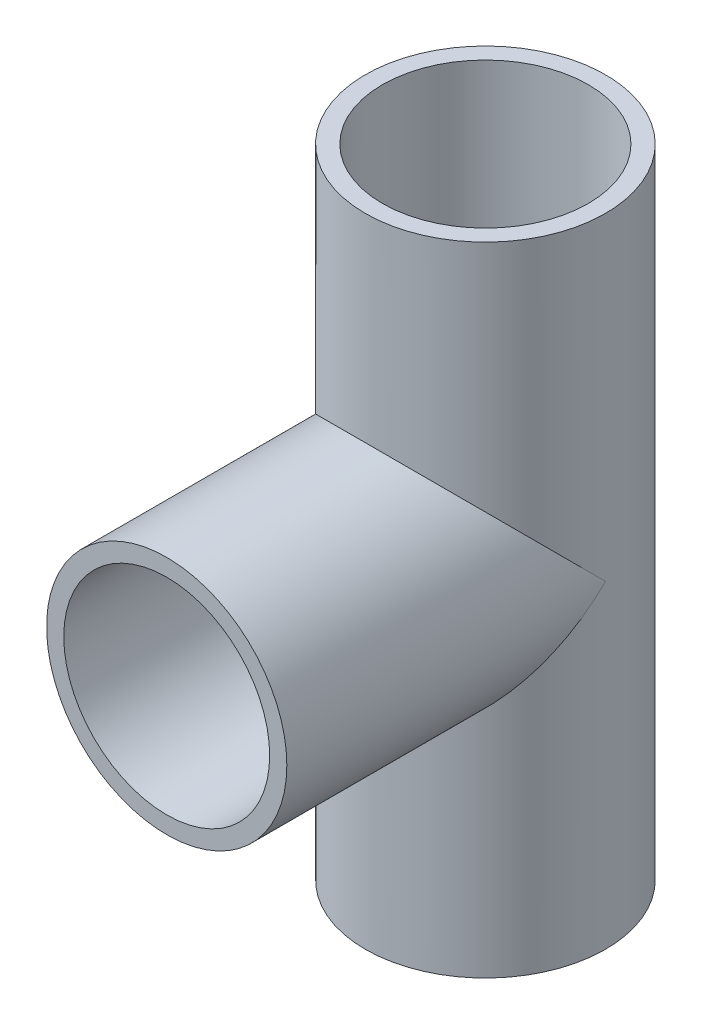
ISO-10303-21;
HEADER;
FILE_DESCRIPTION(('STEP AP214'),'2;1');
FILE_NAME('part.step','',(''),(''),'','','');
FILE_SCHEMA(('AUTOMOTIVE_DESIGN { 1 0 10303 214 1 1 1 1 }'));
ENDSEC;
DATA;
#1=APPLICATION_CONTEXT('core data for automotive mechanical design processes');
#2=APPLICATION_PROTOCOL_DEFINITION('international standard','automotive_design',2000,#1);
#3=PRODUCT_CONTEXT('',#1,'mechanical');
#4=PRODUCT('Part','Part','',(#3));
#5=PRODUCT_RELATED_PRODUCT_CATEGORY('part','',(#4));
#6=PRODUCT_DEFINITION_FORMATION('','',#4);
#7=PRODUCT_DEFINITION_CONTEXT('part definition',#1,'design');
#8=PRODUCT_DEFINITION('design','',#6,#7);
#9=PRODUCT_DEFINITION_SHAPE('','',#8);
#10=(LENGTH_UNIT() NAMED_UNIT(*) SI_UNIT(.MILLI.,.METRE.));
#11=(NAMED_UNIT(*) PLANE_ANGLE_UNIT() SI_UNIT($,.RADIAN.));
#12=(NAMED_UNIT(*) SI_UNIT($,.STERADIAN.) SOLID_ANGLE_UNIT());
#13=UNCERTAINTY_MEASURE_WITH_UNIT(LENGTH_MEASURE(1.E-05),#10,'distance_accuracy_value','');
#14=(GEOMETRIC_REPRESENTATION_CONTEXT(3) GLOBAL_UNCERTAINTY_ASSIGNED_CONTEXT((#13)) GLOBAL_UNIT_ASSIGNED_CONTEXT((#10,
#11,#12)) REPRESENTATION_CONTEXT('',''));
#15=CARTESIAN_POINT('',(0.,0.,0.));
#16=DIRECTION('',(0.,0.,1.));
#17=DIRECTION('',(1.,0.,0.));
#18=AXIS2_PLACEMENT_3D('',#15,#16,#17);
#19=CARTESIAN_POINT('',(0.,130.,0.));
#20=DIRECTION('',(0.,-1.,0.));
#21=DIRECTION('',(0.,0.,-1.));
#22=AXIS2_PLACEMENT_3D('',#19,#20,#21);
#23=CYLINDRICAL_SURFACE('',#22,24.5);
#24=CARTESIAN_POINT('',(0.,0.,0.));
#25=DIRECTION('',(0.,1.,0.));
#26=DIRECTION('',(0.,0.,1.));
#27=AXIS2_PLACEMENT_3D('',#24,#25,#26);
#28=CIRCLE('',#27,24.5);
#29=CARTESIAN_POINT('',(0.,0.,24.5));
#30=VERTEX_POINT('',#29);
#31=EDGE_CURVE('E114',#30,#30,#28,.T.);
#32=ORIENTED_EDGE('',*,*,#31,.T.);
#33=EDGE_LOOP('',(#32));
#34=FACE_BOUND('',#33,.T.);
#35=CARTESIAN_POINT('',(0.,130.,0.));
#36=DIRECTION('',(0.,1.,0.));
#37=DIRECTION('',(0.,0.,1.));
#38=AXIS2_PLACEMENT_3D('',#35,#36,#37);
#39=CIRCLE('',#38,24.5);
#40=CARTESIAN_POINT('',(0.,130.,24.5));
#41=VERTEX_POINT('',#40);
#42=EDGE_CURVE('E118',#41,#41,#39,.T.);
#43=ORIENTED_EDGE('',*,*,#42,.F.);
#44=EDGE_LOOP('',(#43));
#45=FACE_BOUND('',#44,.T.);
#46=CARTESIAN_POINT('',(0.,65.,0.));
#47=DIRECTION('',(0.,-0.707106781186547,-0.707106781186547));
#48=DIRECTION('',(0.,-0.707106781186547,0.707106781186547));
#49=AXIS2_PLACEMENT_3D('',#46,#47,#48);
#50=ELLIPSE('',#49,34.6482322781408,24.5);
#51=CARTESIAN_POINT('',(-24.5,65.,0.));
#52=VERTEX_POINT('',#51);
#53=CARTESIAN_POINT('',(24.5,65.,0.));
#54=VERTEX_POINT('',#53);
#55=EDGE_CURVE('E89',#52,#54,#50,.F.);
#56=ORIENTED_EDGE('',*,*,#55,.F.);
#57=CARTESIAN_POINT('',(0.,65.,0.));
#58=DIRECTION('',(0.,-0.707106781186547,0.707106781186547));
#59=DIRECTION('',(0.,-0.707106781186547,-0.707106781186547));
#60=AXIS2_PLACEMENT_3D('',#57,#58,#59);
#61=ELLIPSE('',#60,34.6482322781408,24.5);
#62=EDGE_CURVE('E91',#54,#52,#61,.T.);
#63=ORIENTED_EDGE('',*,*,#62,.F.);
#64=EDGE_LOOP('',(#56,#63));
#65=FACE_BOUND('',#64,.T.);
#66=ADVANCED_FACE('F39',(#34,#45,#65),#23,.T.);
#67=CARTESIAN_POINT('',(0.,130.,0.));
#68=DIRECTION('',(0.,-1.,0.));
#69=DIRECTION('',(0.,0.,-1.));
#70=AXIS2_PLACEMENT_3D('',#67,#68,#69);
#71=CYLINDRICAL_SURFACE('',#70,21.);
#72=CARTESIAN_POINT('',(0.,130.,0.));
#73=DIRECTION('',(0.,1.,0.));
#74=DIRECTION('',(0.,0.,1.));
#75=AXIS2_PLACEMENT_3D('',#72,#73,#74);
#76=CIRCLE('',#75,21.);
#77=CARTESIAN_POINT('',(0.,130.,21.));
#78=VERTEX_POINT('',#77);
#79=EDGE_CURVE('E110',#78,#78,#76,.T.);
#80=ORIENTED_EDGE('',*,*,#79,.T.);
#81=EDGE_LOOP('',(#80));
#82=FACE_BOUND('',#81,.T.);
#83=CARTESIAN_POINT('',(0.,0.,0.));
#84=DIRECTION('',(0.,1.,0.));
#85=DIRECTION('',(0.,0.,1.));
#86=AXIS2_PLACEMENT_3D('',#83,#84,#85);
#87=CIRCLE('',#86,21.);
#88=CARTESIAN_POINT('',(0.,0.,21.));
#89=VERTEX_POINT('',#88);
#90=EDGE_CURVE('E94',#89,#89,#87,.T.);
#91=ORIENTED_EDGE('',*,*,#90,.F.);
#92=EDGE_LOOP('',(#91));
#93=FACE_BOUND('',#92,.T.);
#94=CARTESIAN_POINT('',(21.,77.619429464124,0.));
#95=CARTESIAN_POINT('',(21.0000033866168,77.6194162914974,0.178405705513538));
#96=CARTESIAN_POINT('',(20.9977258013646,77.623214750097,0.356781199646762));
#97=CARTESIAN_POINT('',(20.9886459828666,77.6383090448937,0.713071315321174));
#98=CARTESIAN_POINT('',(20.9818444796533,77.6496036714207,0.890986006573329));
#99=CARTESIAN_POINT('',(20.9547515279878,77.6944743180999,1.42268837650123));
#100=CARTESIAN_POINT('',(20.9277712557827,77.739038305195,1.77527834255355));
#101=CARTESIAN_POINT('',(20.8572674545965,77.8541354649111,2.46860742822363));
#102=CARTESIAN_POINT('',(20.8140112940652,77.9242483803568,2.80944573941519));
#103=CARTESIAN_POINT('',(20.7118890969017,78.0872797697454,3.48337531312922));
#104=CARTESIAN_POINT('',(20.6530135926556,78.1802120730337,3.81646174322786));
#105=CARTESIAN_POINT('',(20.4923590612934,78.4292031966646,4.6143694401832));
#106=CARTESIAN_POINT('',(20.3830029708772,78.5952551534269,5.07454495747525));
#107=CARTESIAN_POINT('',(20.1372669534914,78.9566544941007,5.97569148692239));
#108=CARTESIAN_POINT('',(20.0008749979289,79.1520149082681,6.41665384399687));
#109=CARTESIAN_POINT('',(19.7018188557052,79.5655077195985,7.28356937274775));
#110=CARTESIAN_POINT('',(19.5389364065977,79.783823460404,7.70935857142068));
#111=CARTESIAN_POINT('',(19.1891710418478,80.2350654843079,8.54283184905344));
#112=CARTESIAN_POINT('',(19.0022890926396,80.4679911788858,8.95051665616872));
#113=CARTESIAN_POINT('',(18.6531918795388,80.8859602121294,9.65260972052875));
#114=CARTESIAN_POINT('',(18.4958739262279,81.0690267558893,9.95065454051124));
#115=CARTESIAN_POINT('',(18.1681132471236,81.4386960890834,10.5371966047626));
#116=CARTESIAN_POINT('',(17.9976693252157,81.6252991996192,10.8256929754884));
#117=CARTESIAN_POINT('',(17.4667252279838,82.1880546919175,11.6773962961455));
#118=CARTESIAN_POINT('',(17.0866738562334,82.5670787979452,12.2266949422212));
#119=CARTESIAN_POINT('',(16.2759104482845,83.3207738589369,13.2867911339944));
#120=CARTESIAN_POINT('',(15.8453242060187,83.6954531751804,13.7976792969827));
#121=CARTESIAN_POINT('',(14.932523326238,84.4322808440698,14.7807059182648));
#122=CARTESIAN_POINT('',(14.4503302845369,84.7944343550707,15.2528604403756));
#123=CARTESIAN_POINT('',(13.5470371420192,85.4195707867214,16.05481078272));
#124=CARTESIAN_POINT('',(13.1361731791622,85.6867073532158,16.3929254453808));
#125=CARTESIAN_POINT('',(12.2831723550678,86.2043044824309,17.0414411945222));
#126=CARTESIAN_POINT('',(11.8410364858956,86.454765573673,17.3518431594502));
#127=CARTESIAN_POINT('',(10.9264528298276,86.9346505420357,17.9418025993258));
#128=CARTESIAN_POINT('',(10.4540385248886,87.1640969975439,18.2213932455907));
#129=CARTESIAN_POINT('',(9.72352640074739,87.4894227881324,18.6153053315232));
#130=CARTESIAN_POINT('',(9.47638346417478,87.5947205220726,18.7423594830914));
#131=CARTESIAN_POINT('',(8.97491268664032,87.7985572881808,18.9875977175306));
#132=CARTESIAN_POINT('',(8.720582997143,87.8970945587034,19.1057794891822));
#133=CARTESIAN_POINT('',(8.04075480825821,88.1473201502708,19.4051243633132));
#134=CARTESIAN_POINT('',(7.60946563060112,88.2928611300023,19.5784264346903));
#135=CARTESIAN_POINT('',(6.73033462929532,88.5619158784692,19.8977705517759));
#136=CARTESIAN_POINT('',(6.28249611113591,88.6854340175434,20.043818006316));
#137=CARTESIAN_POINT('',(5.37257567537549,88.9082557086086,20.3066380237625));
#138=CARTESIAN_POINT('',(4.91049941155926,89.007568736308,20.4234220430923));
#139=CARTESIAN_POINT('',(3.97477377777793,89.1801052099514,20.6259618786052));
#140=CARTESIAN_POINT('',(3.50112427801742,89.2533283631504,20.7117173466282));
#141=CARTESIAN_POINT('',(2.54330282659993,89.3724354470442,20.8510653583634));
#142=CARTESIAN_POINT('',(2.05909091405331,89.4181847360777,20.9044995135392));
#143=CARTESIAN_POINT('',(1.08624852734474,89.480760444759,20.9775591727101));
#144=CARTESIAN_POINT('',(0.597618043556711,89.4975868013815,20.9971846030333));
#145=CARTESIAN_POINT('',(-0.379907610101939,89.5019295448868,21.0022511332723));
#146=CARTESIAN_POINT('',(-0.868802754113375,89.489448408702,20.9876951220439));
#147=CARTESIAN_POINT('',(-1.84276489086391,89.435467543279,20.9246825354964));
#148=CARTESIAN_POINT('',(-2.32783205189619,89.3939690970245,20.8762274590049));
#149=CARTESIAN_POINT('',(-3.25303566079414,89.2871905132304,20.7513512527613));
#150=CARTESIAN_POINT('',(-3.69374867103346,89.2239948204666,20.6773792654436));
#151=CARTESIAN_POINT('',(-4.56582553056686,89.0748605905003,20.5024633035779));
#152=CARTESIAN_POINT('',(-4.99718996869258,88.9889234902249,20.4015210331566));
#153=CARTESIAN_POINT('',(-5.84823854093265,88.7957673684653,20.1740464979365));
#154=CARTESIAN_POINT('',(-6.26792199656694,88.6885471136962,20.0475127501923));
#155=CARTESIAN_POINT('',(-7.09365955387852,88.4545132290059,19.7704246458532));
#156=CARTESIAN_POINT('',(-7.49971280592898,88.3276983804232,19.6198687952144));
#157=CARTESIAN_POINT('',(-8.32701513332972,88.0459548066059,19.2840610286047));
#158=CARTESIAN_POINT('',(-8.7470660982476,87.8896204654514,19.0970398921074));
#159=CARTESIAN_POINT('',(-9.56820053793125,87.5587129258627,18.6991372697195));
#160=CARTESIAN_POINT('',(-9.96928356617994,87.3841392983745,18.4882552225243));
#161=CARTESIAN_POINT('',(-10.7517365537377,87.0190061451469,18.0444605982839));
#162=CARTESIAN_POINT('',(-11.133097162268,86.8284391469322,17.8115377166934));
#163=CARTESIAN_POINT('',(-11.8753738550352,86.4336720067981,17.3254835211682));
#164=CARTESIAN_POINT('',(-12.2362857728353,86.229469104886,17.0723481140487));
#165=CARTESIAN_POINT('',(-13.1136769365262,85.7040677786153,16.4153797419073));
#166=CARTESIAN_POINT('',(-13.6171105383645,85.3756781278534,15.9997824479127));
#167=CARTESIAN_POINT('',(-14.5768381415365,84.7005150299162,15.1306087818174));
#168=CARTESIAN_POINT('',(-15.0331101863781,84.3537331327291,14.6770148963821));
#169=CARTESIAN_POINT('',(-15.8995119006966,83.6485416932351,13.7337734222572));
#170=CARTESIAN_POINT('',(-16.3095390354032,83.2901084977941,13.244049550754));
#171=CARTESIAN_POINT('',(-17.0824385092326,82.5703967411758,12.2309545840431));
#172=CARTESIAN_POINT('',(-17.445325236691,82.2091190840703,11.707593828832));
#173=CARTESIAN_POINT('',(-18.0532715212479,81.5675014725851,10.7393945264237));
#174=CARTESIAN_POINT('',(-18.3071402340035,81.2859546245426,10.3008616881067));
#175=CARTESIAN_POINT('',(-18.7848135679006,80.7325863041435,9.4015991529958));
#176=CARTESIAN_POINT('',(-19.008613272251,80.4607664276294,8.940865842743));
#177=CARTESIAN_POINT('',(-19.4245311242877,79.9348485932638,7.99706238935469));
#178=CARTESIAN_POINT('',(-19.6167198280696,79.6807119190629,7.51404515941921));
#179=CARTESIAN_POINT('',(-19.9680260125729,79.1991754929303,6.52332984673244));
#180=CARTESIAN_POINT('',(-20.1271658218884,78.9717577344904,6.0156487155043));
#181=CARTESIAN_POINT('',(-20.3555599646593,78.6354494380855,5.17324085573681));
#182=CARTESIAN_POINT('',(-20.4359528753335,78.5144242499949,4.84636097466921));
#183=CARTESIAN_POINT('',(-20.5819840127561,78.2909642651429,4.18297197093722));
#184=CARTESIAN_POINT('',(-20.6476217339998,78.188530105323,3.84646251881411));
#185=CARTESIAN_POINT('',(-20.7628365935309,78.0063919393587,3.16595096781703));
#186=CARTESIAN_POINT('',(-20.8124720017484,77.9266055946239,2.82198103479399));
#187=CARTESIAN_POINT('',(-20.8949114093261,77.7929233462507,2.12717739752639));
#188=CARTESIAN_POINT('',(-20.9277266132213,77.7390102090802,1.77634842447519));
#189=CARTESIAN_POINT('',(-20.9677212030416,77.6730278150252,1.18764462072745));
#190=CARTESIAN_POINT('',(-20.9797955693231,77.6530074785398,0.95096731036854));
#191=CARTESIAN_POINT('',(-20.9959493401236,77.6261704892702,0.476211714162272));
#192=CARTESIAN_POINT('',(-21.0000157402303,77.6193753134894,0.238131778223571));
#193=CARTESIAN_POINT('',(-21.,77.619429464124,0.));
#194=B_SPLINE_CURVE_WITH_KNOTS('',3,(#94,#95,#96,#97,#98,#99,#100,#101,#102,#103,#104,#105,#106,
#107,#108,#109,#110,#111,#112,#113,#114,#115,#116,#117,#118,#119,#120,#121,#122,#123,#124,#125,
#126,#127,#128,#129,#130,#131,#132,#133,#134,#135,#136,#137,#138,#139,#140,#141,#142,#143,#144,
#145,#146,#147,#148,#149,#150,#151,#152,#153,#154,#155,#156,#157,#158,#159,#160,#161,#162,#163,
#164,#165,#166,#167,#168,#169,#170,#171,#172,#173,#174,#175,#176,#177,#178,#179,#180,#181,#182,
#183,#184,#185,#186,#187,#188,#189,#190,#191,#192,#193),.UNSPECIFIED.,.F.,.F.,(4,2,2,2,2,2,2,2,
2,2,2,2,2,2,2,2,2,2,2,2,2,2,2,2,2,2,2,2,2,2,2,2,2,2,2,2,2,2,2,2,2,2,2,2,2,2,2,2,2,4),(0.,
0.535104056607532,1.07012178350267,2.13763627307263,3.18833008360276,4.23966222966618,
5.74104783219043,7.24310292525352,8.75822700019641,10.2732900818225,11.4235082145623,
12.5738312861637,14.8749434651224,17.170444469244,19.464988607153,21.2496288812896,
23.0342125651297,24.8168558079941,25.7081114785515,26.5995985177896,28.059223679168,
29.5185588609848,30.9773218278691,32.436101162495,33.9019724288756,35.3678468894974,
36.8335974657108,38.2992832387026,39.6517610698141,41.0041534643479,42.3566242482156,
43.7091791812023,45.164749775243,46.6203546172865,48.0766433789305,49.5332278013292,
51.7223481486426,53.912483113386,56.1073823794607,58.3016101298323,60.0395071125341,
61.777687925817,63.5119348477416,65.2450062329785,66.3173970193745,67.389824539693,
68.4583016798466,69.5260661414404,70.239079172496,70.9532491382859),.UNSPECIFIED.);
#195=CARTESIAN_POINT('',(21.,77.619429464124,0.));
#196=VERTEX_POINT('',#195);
#197=CARTESIAN_POINT('',(-21.,77.619429464124,0.));
#198=VERTEX_POINT('',#197);
#199=EDGE_CURVE('E44',#196,#198,#194,.T.);
#200=ORIENTED_EDGE('',*,*,#199,.T.);
#201=DIRECTION('',(0.,-1.,0.));
#202=VECTOR('',#201,1.);
#203=CARTESIAN_POINT('',(-21.,130.,0.));
#204=LINE('',#203,#202);
#205=CARTESIAN_POINT('',(-21.,65.,0.));
#206=VERTEX_POINT('',#205);
#207=EDGE_CURVE('E11',#198,#206,#204,.T.);
#208=ORIENTED_EDGE('',*,*,#207,.T.);
#209=CARTESIAN_POINT('',(-21.,52.380570535876,0.));
#210=VERTEX_POINT('',#209);
#211=EDGE_CURVE('E58',#206,#210,#204,.T.);
#212=ORIENTED_EDGE('',*,*,#211,.T.);
#213=CARTESIAN_POINT('',(-21.,52.380570535876,0.));
#214=CARTESIAN_POINT('',(-21.0000033866168,52.3805837085026,0.178405705513538));
#215=CARTESIAN_POINT('',(-20.9977258013646,52.376785249903,0.356781199646761));
#216=CARTESIAN_POINT('',(-20.9886459828666,52.3616909551063,0.713071315321173));
#217=CARTESIAN_POINT('',(-20.9818444796533,52.3503963285793,0.890986006573327));
#218=CARTESIAN_POINT('',(-20.9547515279878,52.3055256819001,1.42268837650123));
#219=CARTESIAN_POINT('',(-20.9277712557827,52.2609616948051,1.77527834255355));
#220=CARTESIAN_POINT('',(-20.8572674545965,52.1458645350889,2.46860742822363));
#221=CARTESIAN_POINT('',(-20.8140112940652,52.0757516196432,2.80944573941519));
#222=CARTESIAN_POINT('',(-20.7118890969017,51.9127202302546,3.48337531312922));
#223=CARTESIAN_POINT('',(-20.6530135926556,51.8197879269663,3.81646174322786));
#224=CARTESIAN_POINT('',(-20.4923590612934,51.5707968033354,4.61436944018319));
#225=CARTESIAN_POINT('',(-20.3830029708772,51.4047448465731,5.07454495747524));
#226=CARTESIAN_POINT('',(-20.1372669534914,51.0433455058993,5.97569148692238));
#227=CARTESIAN_POINT('',(-20.0008749979289,50.8479850917319,6.41665384399686));
#228=CARTESIAN_POINT('',(-19.7018188557052,50.4344922804015,7.28356937274774));
#229=CARTESIAN_POINT('',(-19.5389364065977,50.216176539596,7.70935857142067));
#230=CARTESIAN_POINT('',(-19.1891710418478,49.7649345156921,8.54283184905343));
#231=CARTESIAN_POINT('',(-19.0022890926396,49.5320088211142,8.95051665616871));
#232=CARTESIAN_POINT('',(-18.6531918795388,49.1140397878706,9.65260972052874));
#233=CARTESIAN_POINT('',(-18.4958739262279,48.9309732441107,9.95065454051123));
#234=CARTESIAN_POINT('',(-18.1681132471236,48.5613039109166,10.5371966047626));
#235=CARTESIAN_POINT('',(-17.9976693252158,48.3747008003808,10.8256929754884));
#236=CARTESIAN_POINT('',(-17.4667252279838,47.8119453080825,11.6773962961455));
#237=CARTESIAN_POINT('',(-17.0866738562334,47.4329212020548,12.2266949422212));
#238=CARTESIAN_POINT('',(-16.2759104482845,46.6792261410631,13.2867911339944));
#239=CARTESIAN_POINT('',(-15.8453242060187,46.3045468248196,13.7976792969827));
#240=CARTESIAN_POINT('',(-14.932523326238,45.5677191559302,14.7807059182648));
#241=CARTESIAN_POINT('',(-14.4503302845369,45.2055656449293,15.2528604403756));
#242=CARTESIAN_POINT('',(-13.5470371420192,44.5804292132786,16.05481078272));
#243=CARTESIAN_POINT('',(-13.1361731791622,44.3132926467842,16.3929254453808));
#244=CARTESIAN_POINT('',(-12.2831723550678,43.7956955175691,17.0414411945222));
#245=CARTESIAN_POINT('',(-11.8410364858956,43.545234426327,17.3518431594502));
#246=CARTESIAN_POINT('',(-10.9264528298276,43.0653494579643,17.9418025993258));
#247=CARTESIAN_POINT('',(-10.4540385248886,42.8359030024561,18.2213932455907));
#248=CARTESIAN_POINT('',(-9.72352640074738,42.5105772118676,18.6153053315232));
#249=CARTESIAN_POINT('',(-9.47638346417478,42.4052794779274,18.7423594830914));
#250=CARTESIAN_POINT('',(-8.97491268664031,42.2014427118192,18.9875977175306));
#251=CARTESIAN_POINT('',(-8.72058299714299,42.1029054412966,19.1057794891822));
#252=CARTESIAN_POINT('',(-8.0407548082582,41.8526798497292,19.4051243633132));
#253=CARTESIAN_POINT('',(-7.60946563060111,41.7071388699977,19.5784264346903));
#254=CARTESIAN_POINT('',(-6.73033462929532,41.4380841215308,19.8977705517759));
#255=CARTESIAN_POINT('',(-6.28249611113591,41.3145659824566,20.043818006316));
#256=CARTESIAN_POINT('',(-5.37257567537549,41.0917442913914,20.3066380237625));
#257=CARTESIAN_POINT('',(-4.91049941155926,40.992431263692,20.4234220430923));
#258=CARTESIAN_POINT('',(-3.97477377777793,40.8198947900485,20.6259618786052));
#259=CARTESIAN_POINT('',(-3.50112427801742,40.7466716368496,20.7117173466282));
#260=CARTESIAN_POINT('',(-2.54330282659993,40.6275645529558,20.8510653583634));
#261=CARTESIAN_POINT('',(-2.05909091405331,40.5818152639223,20.9044995135392));
#262=CARTESIAN_POINT('',(-1.08624852734474,40.5192395552411,20.9775591727101));
#263=CARTESIAN_POINT('',(-0.597618043556714,40.5024131986185,20.9971846030333));
#264=CARTESIAN_POINT('',(0.379907610101936,40.4980704551132,21.0022511332723));
#265=CARTESIAN_POINT('',(0.868802754113374,40.510551591298,20.9876951220439));
#266=CARTESIAN_POINT('',(1.84276489086391,40.564532456721,20.9246825354964));
#267=CARTESIAN_POINT('',(2.32783205189619,40.6060309029755,20.8762274590049));
#268=CARTESIAN_POINT('',(3.25303566079414,40.7128094867696,20.7513512527613));
#269=CARTESIAN_POINT('',(3.69374867103347,40.7760051795335,20.6773792654436));
#270=CARTESIAN_POINT('',(4.56582553056686,40.9251394094997,20.5024633035779));
#271=CARTESIAN_POINT('',(4.99718996869259,41.0110765097751,20.4015210331566));
#272=CARTESIAN_POINT('',(5.84823854093265,41.2042326315347,20.1740464979365));
#273=CARTESIAN_POINT('',(6.26792199656695,41.3114528863038,20.0475127501923));
#274=CARTESIAN_POINT('',(7.09365955387852,41.5454867709941,19.7704246458532));
#275=CARTESIAN_POINT('',(7.49971280592898,41.6723016195768,19.6198687952144));
#276=CARTESIAN_POINT('',(8.32701513332972,41.9540451933941,19.2840610286047));
#277=CARTESIAN_POINT('',(8.7470660982476,42.1103795345486,19.0970398921074));
#278=CARTESIAN_POINT('',(9.56820053793125,42.4412870741373,18.6991372697195));
#279=CARTESIAN_POINT('',(9.96928356617994,42.6158607016255,18.4882552225243));
#280=CARTESIAN_POINT('',(10.7517365537377,42.9809938548531,18.0444605982839));
#281=CARTESIAN_POINT('',(11.133097162268,43.1715608530679,17.8115377166934));
#282=CARTESIAN_POINT('',(11.8753738550352,43.5663279932019,17.3254835211682));
#283=CARTESIAN_POINT('',(12.2362857728353,43.770530895114,17.0723481140487));
#284=CARTESIAN_POINT('',(13.1136769365262,44.2959322213847,16.4153797419073));
#285=CARTESIAN_POINT('',(13.6171105383645,44.6243218721466,15.9997824479127));
#286=CARTESIAN_POINT('',(14.5768381415365,45.2994849700838,15.1306087818174));
#287=CARTESIAN_POINT('',(15.0331101863781,45.6462668672709,14.6770148963821));
#288=CARTESIAN_POINT('',(15.8995119006967,46.3514583067649,13.7337734222572));
#289=CARTESIAN_POINT('',(16.3095390354032,46.709891502206,13.244049550754));
#290=CARTESIAN_POINT('',(17.0824385092326,47.4296032588243,12.2309545840431));
#291=CARTESIAN_POINT('',(17.445325236691,47.7908809159298,11.707593828832));
#292=CARTESIAN_POINT('',(18.0532715212479,48.4324985274149,10.7393945264237));
#293=CARTESIAN_POINT('',(18.3071402340035,48.7140453754574,10.3008616881067));
#294=CARTESIAN_POINT('',(18.7848135679006,49.2674136958565,9.40159915299578));
#295=CARTESIAN_POINT('',(19.008613272251,49.5392335723707,8.94086584274298));
#296=CARTESIAN_POINT('',(19.4245311242877,50.0651514067363,7.99706238935468));
#297=CARTESIAN_POINT('',(19.6167198280696,50.3192880809371,7.51404515941921));
#298=CARTESIAN_POINT('',(19.9680260125729,50.8008245070698,6.52332984673243));
#299=CARTESIAN_POINT('',(20.1271658218884,51.0282422655096,6.01564871550428));
#300=CARTESIAN_POINT('',(20.3555599646593,51.3645505619145,5.1732408557368));
#301=CARTESIAN_POINT('',(20.4359528753336,51.4855757500051,4.8463609746692));
#302=CARTESIAN_POINT('',(20.5819840127561,51.7090357348571,4.18297197093721));
#303=CARTESIAN_POINT('',(20.6476217339998,51.811469894677,3.8464625188141));
#304=CARTESIAN_POINT('',(20.7628365935309,51.9936080606413,3.16595096781702));
#305=CARTESIAN_POINT('',(20.8124720017484,52.0733944053762,2.82198103479398));
#306=CARTESIAN_POINT('',(20.8949114093261,52.2070766537494,2.12717739752638));
#307=CARTESIAN_POINT('',(20.9277266132213,52.2609897909198,1.77634842447518));
#308=CARTESIAN_POINT('',(20.9677212030416,52.3269721849748,1.18764462072744));
#309=CARTESIAN_POINT('',(20.9797955693231,52.3469925214602,0.950967310368536));
#310=CARTESIAN_POINT('',(20.9959493401236,52.3738295107299,0.476211714162272));
#311=CARTESIAN_POINT('',(21.0000157402303,52.3806246865107,0.238131778223572));
#312=CARTESIAN_POINT('',(21.,52.380570535876,0.));
#313=B_SPLINE_CURVE_WITH_KNOTS('',3,(#213,#214,#215,#216,#217,#218,#219,#220,#221,#222,#223,
#224,#225,#226,#227,#228,#229,#230,#231,#232,#233,#234,#235,#236,#237,#238,#239,#240,#241,#242,
#243,#244,#245,#246,#247,#248,#249,#250,#251,#252,#253,#254,#255,#256,#257,#258,#259,#260,#261,
#262,#263,#264,#265,#266,#267,#268,#269,#270,#271,#272,#273,#274,#275,#276,#277,#278,#279,#280,
#281,#282,#283,#284,#285,#286,#287,#288,#289,#290,#291,#292,#293,#294,#295,#296,#297,#298,#299,
#300,#301,#302,#303,#304,#305,#306,#307,#308,#309,#310,#311,#312),.UNSPECIFIED.,.F.,.F.,(4,2,2,
2,2,2,2,2,2,2,2,2,2,2,2,2,2,2,2,2,2,2,2,2,2,2,2,2,2,2,2,2,2,2,2,2,2,2,2,2,2,2,2,2,2,2,2,2,2,4),
(0.,0.535104056607531,1.07012178350267,2.13763627307263,3.18833008360276,4.23966222966618,
5.74104783219043,7.24310292525351,8.75822700019639,10.2732900818225,11.4235082145623,
12.5738312861637,14.8749434651224,17.170444469244,19.464988607153,21.2496288812896,
23.0342125651297,24.8168558079941,25.7081114785515,26.5995985177897,28.059223679168,
29.5185588609848,30.9773218278691,32.436101162495,33.9019724288756,35.3678468894974,
36.8335974657108,38.2992832387026,39.6517610698141,41.0041534643479,42.3566242482156,
43.7091791812023,45.164749775243,46.6203546172865,48.0766433789305,49.5332278013292,
51.7223481486426,53.912483113386,56.1073823794608,58.3016101298324,60.0395071125342,
61.777687925817,63.5119348477416,65.2450062329785,66.3173970193745,67.389824539693,
68.4583016798466,69.5260661414404,70.239079172496,70.9532491382859),.UNSPECIFIED.);
#314=CARTESIAN_POINT('',(21.,52.380570535876,0.));
#315=VERTEX_POINT('',#314);
#316=EDGE_CURVE('E135',#210,#315,#313,.T.);
#317=ORIENTED_EDGE('',*,*,#316,.T.);
#318=DIRECTION('',(0.,-1.,0.));
#319=VECTOR('',#318,1.);
#320=CARTESIAN_POINT('',(21.,130.,0.));
#321=LINE('',#320,#319);
#322=CARTESIAN_POINT('',(21.,65.,0.));
#323=VERTEX_POINT('',#322);
#324=EDGE_CURVE('E56',#315,#323,#321,.F.);
#325=ORIENTED_EDGE('',*,*,#324,.T.);
#326=EDGE_CURVE('E132',#323,#196,#321,.F.);
#327=ORIENTED_EDGE('',*,*,#326,.T.);
#328=EDGE_LOOP('',(#200,#208,#212,#317,#325,#327));
#329=FACE_BOUND('',#328,.T.);
#330=ADVANCED_FACE('F177',(#82,#93,#329),#71,.F.);
#331=CARTESIAN_POINT('',(0.,130.,0.));
#332=DIRECTION('',(0.,1.,0.));
#333=DIRECTION('',(0.,0.,1.));
#334=AXIS2_PLACEMENT_3D('',#331,#332,#333);
#335=PLANE('',#334);
#336=ORIENTED_EDGE('',*,*,#42,.T.);
#337=EDGE_LOOP('',(#336));
#338=FACE_BOUND('',#337,.T.);
#339=ORIENTED_EDGE('',*,*,#79,.F.);
#340=EDGE_LOOP('',(#339));
#341=FACE_BOUND('',#340,.T.);
#342=ADVANCED_FACE('F170',(#338,#341),#335,.T.);
#343=CARTESIAN_POINT('',(0.,0.,0.));
#344=DIRECTION('',(0.,1.,0.));
#345=DIRECTION('',(0.,0.,1.));
#346=AXIS2_PLACEMENT_3D('',#343,#344,#345);
#347=PLANE('',#346);
#348=ORIENTED_EDGE('',*,*,#31,.F.);
#349=EDGE_LOOP('',(#348));
#350=FACE_BOUND('',#349,.T.);
#351=ORIENTED_EDGE('',*,*,#90,.T.);
#352=EDGE_LOOP('',(#351));
#353=FACE_BOUND('',#352,.T.);
#354=ADVANCED_FACE('F164',(#350,#353),#347,.F.);
#355=CARTESIAN_POINT('',(0.,65.,65.));
#356=DIRECTION('',(0.,0.,-1.));
#357=DIRECTION('',(-1.,0.,0.));
#358=AXIS2_PLACEMENT_3D('',#355,#356,#357);
#359=CYLINDRICAL_SURFACE('',#358,21.);
#360=CARTESIAN_POINT('',(0.,65.,0.));
#361=DIRECTION('',(0.,0.,1.));
#362=DIRECTION('',(1.,0.,0.));
#363=AXIS2_PLACEMENT_3D('',#360,#361,#362);
#364=CIRCLE('',#363,21.);
#365=EDGE_CURVE('E70',#323,#206,#364,.T.);
#366=ORIENTED_EDGE('',*,*,#365,.F.);
#367=CARTESIAN_POINT('',(0.,65.,0.));
#368=DIRECTION('',(0.,-0.707106781186547,0.707106781186547));
#369=DIRECTION('',(0.,-0.707106781186547,-0.707106781186547));
#370=AXIS2_PLACEMENT_3D('',#367,#368,#369);
#371=ELLIPSE('',#370,29.698484809835,21.);
#372=EDGE_CURVE('E122',#323,#206,#371,.T.);
#373=ORIENTED_EDGE('',*,*,#372,.T.);
#374=EDGE_LOOP('',(#366,#373));
#375=FACE_BOUND('',#374,.T.);
#376=ADVANCED_FACE('F161',(#375),#359,.F.);
#377=CARTESIAN_POINT('',(0.,65.,65.));
#378=DIRECTION('',(0.,0.,-1.));
#379=DIRECTION('',(-1.,0.,0.));
#380=AXIS2_PLACEMENT_3D('',#377,#378,#379);
#381=CYLINDRICAL_SURFACE('',#380,24.5);
#382=ORIENTED_EDGE('',*,*,#199,.F.);
#383=CARTESIAN_POINT('',(0.,65.,0.));
#384=DIRECTION('',(0.,0.,1.));
#385=DIRECTION('',(1.,0.,0.));
#386=AXIS2_PLACEMENT_3D('',#383,#384,#385);
#387=CIRCLE('',#386,24.5);
#388=EDGE_CURVE('E274',#196,#198,#387,.T.);
#389=ORIENTED_EDGE('',*,*,#388,.T.);
#390=EDGE_LOOP('',(#382,#389));
#391=FACE_BOUND('',#390,.T.);
#392=ADVANCED_FACE('F150',(#391),#381,.T.);
#393=CARTESIAN_POINT('',(0.,65.,0.));
#394=DIRECTION('',(0.,0.,1.));
#395=DIRECTION('',(1.,0.,0.));
#396=AXIS2_PLACEMENT_3D('',#393,#394,#395);
#397=PLANE('',#396);
#398=ORIENTED_EDGE('',*,*,#207,.F.);
#399=ORIENTED_EDGE('',*,*,#388,.F.);
#400=ORIENTED_EDGE('',*,*,#326,.F.);
#401=ORIENTED_EDGE('',*,*,#365,.T.);
#402=EDGE_LOOP('',(#398,#399,#400,#401));
#403=FACE_BOUND('',#402,.T.);
#404=ADVANCED_FACE('F156',(#403),#397,.F.);
#405=CARTESIAN_POINT('',(0.,65.,0.));
#406=DIRECTION('',(0.,-0.707106781186547,-0.707106781186547));
#407=DIRECTION('',(0.,-0.707106781186547,0.707106781186547));
#408=AXIS2_PLACEMENT_3D('',#405,#406,#407);
#409=ELLIPSE('',#408,29.698484809835,21.);
#410=EDGE_CURVE('E128',#206,#323,#409,.F.);
#411=ORIENTED_EDGE('',*,*,#410,.F.);
#412=ORIENTED_EDGE('',*,*,#372,.F.);
#413=EDGE_LOOP('',(#411,#412));
#414=FACE_BOUND('',#413,.T.);
#415=ADVANCED_FACE('F141',(#414),#71,.F.);
#416=ORIENTED_EDGE('',*,*,#316,.F.);
#417=EDGE_CURVE('E277',#210,#315,#387,.T.);
#418=ORIENTED_EDGE('',*,*,#417,.T.);
#419=EDGE_LOOP('',(#416,#418));
#420=FACE_BOUND('',#419,.T.);
#421=ADVANCED_FACE('F144',(#420),#381,.T.);
#422=EDGE_CURVE('E287',#206,#323,#364,.T.);
#423=ORIENTED_EDGE('',*,*,#422,.F.);
#424=ORIENTED_EDGE('',*,*,#410,.T.);
#425=EDGE_LOOP('',(#423,#424));
#426=FACE_BOUND('',#425,.T.);
#427=ADVANCED_FACE('F148',(#426),#359,.F.);
#428=ORIENTED_EDGE('',*,*,#211,.F.);
#429=ORIENTED_EDGE('',*,*,#422,.T.);
#430=ORIENTED_EDGE('',*,*,#324,.F.);
#431=ORIENTED_EDGE('',*,*,#417,.F.);
#432=EDGE_LOOP('',(#428,#429,#430,#431));
#433=FACE_BOUND('',#432,.T.);
#434=ADVANCED_FACE('F151',(#433),#397,.F.);
#435=CARTESIAN_POINT('',(0.,65.,65.));
#436=DIRECTION('',(0.,0.,1.));
#437=DIRECTION('',(1.,0.,0.));
#438=AXIS2_PLACEMENT_3D('',#435,#436,#437);
#439=CIRCLE('',#438,24.5);
#440=CARTESIAN_POINT('',(24.5,65.,65.));
#441=VERTEX_POINT('',#440);
#442=EDGE_CURVE('E102',#441,#441,#439,.T.);
#443=ORIENTED_EDGE('',*,*,#442,.F.);
#444=EDGE_LOOP('',(#443));
#445=FACE_BOUND('',#444,.T.);
#446=ORIENTED_EDGE('',*,*,#62,.T.);
#447=ORIENTED_EDGE('',*,*,#55,.T.);
#448=EDGE_LOOP('',(#446,#447));
#449=FACE_BOUND('',#448,.T.);
#450=ADVANCED_FACE('F96',(#445,#449),#381,.T.);
#451=CARTESIAN_POINT('',(0.,65.,65.));
#452=DIRECTION('',(0.,0.,1.));
#453=DIRECTION('',(1.,0.,0.));
#454=AXIS2_PLACEMENT_3D('',#451,#452,#453);
#455=CIRCLE('',#454,21.);
#456=CARTESIAN_POINT('',(21.,65.,65.));
#457=VERTEX_POINT('',#456);
#458=EDGE_CURVE('E283',#457,#457,#455,.T.);
#459=ORIENTED_EDGE('',*,*,#458,.T.);
#460=EDGE_LOOP('',(#459));
#461=FACE_BOUND('',#460,.T.);
#462=CARTESIAN_POINT('',(-21.,65.,12.619429464124));
#463=CARTESIAN_POINT('',(-20.9999980474076,64.6472040902061,12.6194353251316));
#464=CARTESIAN_POINT('',(-20.9910849704834,64.2943750065156,12.6343013770544));
#465=CARTESIAN_POINT('',(-20.955692228759,63.5918883259771,12.6929148645118));
#466=CARTESIAN_POINT('',(-20.929203364794,63.2422324872049,12.7366774244168));
#467=CARTESIAN_POINT('',(-20.8593076857858,62.5482134873279,12.8508262447997));
#468=CARTESIAN_POINT('',(-20.8158602774447,62.2038651019756,12.9212763747115));
#469=CARTESIAN_POINT('',(-20.7130351255027,61.5231095775454,13.0854698014983));
#470=CARTESIAN_POINT('',(-20.653650683867,61.1867058422802,13.1792228909422));
#471=CARTESIAN_POINT('',(-20.5394573361629,60.6195467006891,13.3562089959284));
#472=CARTESIAN_POINT('',(-20.4883330788367,60.3864967746943,13.4345827598655));
#473=CARTESIAN_POINT('',(-20.3789841170839,59.9252430502535,13.5998838560476));
#474=CARTESIAN_POINT('',(-20.3207615153649,59.6970378400865,13.6868086537955));
#475=CARTESIAN_POINT('',(-20.1358376394761,59.019410819021,13.9587239027896));
#476=CARTESIAN_POINT('',(-19.998920134405,58.577172924374,14.1547922689782));
#477=CARTESIAN_POINT('',(-19.6995537370489,57.7103810968332,14.5685636147781));
#478=CARTESIAN_POINT('',(-19.5370300283968,57.2858837472335,14.7863292819044));
#479=CARTESIAN_POINT('',(-19.1881168260909,56.4548726936402,15.2363788096255));
#480=CARTESIAN_POINT('',(-19.0017289357253,56.048357783983,15.4686616943613));
#481=CARTESIAN_POINT('',(-18.6532985380945,55.3476040195543,15.8858326272401));
#482=CARTESIAN_POINT('',(-18.4960972104001,55.0497682846005,16.068766969511));
#483=CARTESIAN_POINT('',(-18.1685883282499,54.4636303781894,16.4381682038465));
#484=CARTESIAN_POINT('',(-17.9982796078111,54.1753290581457,16.6246354090661));
#485=CARTESIAN_POINT('',(-17.4677657512421,53.3241868793304,17.1869855419473));
#486=CARTESIAN_POINT('',(-17.0880367715679,52.7752357588881,17.5657392444134));
#487=CARTESIAN_POINT('',(-16.2774179201335,51.7150320995656,18.3194447831197));
#488=CARTESIAN_POINT('',(-15.8465811129481,51.2037413374638,18.6944001314843));
#489=CARTESIAN_POINT('',(-14.9332063663583,50.2199628395894,19.4317678229997));
#490=CARTESIAN_POINT('',(-14.4506900935527,49.7474589880465,19.7941853389728));
#491=CARTESIAN_POINT('',(-13.5469862499657,48.9451440448001,20.4196060114049));
#492=CARTESIAN_POINT('',(-13.1360674370236,48.6069875316925,20.6867761081455));
#493=CARTESIAN_POINT('',(-12.2829491141695,47.9583957130608,21.2044353516938));
#494=CARTESIAN_POINT('',(-11.8407506190739,47.6479595089367,21.4549250391578));
#495=CARTESIAN_POINT('',(-10.9261514334475,47.0580158993242,21.9347992255607));
#496=CARTESIAN_POINT('',(-10.4537921143437,46.7784675045772,22.1642116249837));
#497=CARTESIAN_POINT('',(-9.7233681899401,46.3846125487289,22.4894907973828));
#498=CARTESIAN_POINT('',(-9.47625559363735,46.2575763934967,22.5947737411394));
#499=CARTESIAN_POINT('',(-8.97484737269352,46.012371932384,22.7985825935687));
#500=CARTESIAN_POINT('',(-8.72054989996179,45.8942059371963,22.897106740991));
#501=CARTESIAN_POINT('',(-8.04076310842657,45.5948792916626,23.14731709497));
#502=CARTESIAN_POINT('',(-7.60948258278379,45.4215803771073,23.2928554094614));
#503=CARTESIAN_POINT('',(-6.7303694863991,45.1022414562826,23.5619057428617));
#504=CARTESIAN_POINT('',(-6.2825402200158,44.9561960430474,23.6854221305997));
#505=CARTESIAN_POINT('',(-5.37262089644042,44.6933737297139,23.9082457199166));
#506=CARTESIAN_POINT('',(-4.91053592786195,44.5765865185284,24.0075614498798));
#507=CARTESIAN_POINT('',(-3.97479237102105,44.374041488454,24.1801023347573));
#508=CARTESIAN_POINT('',(-3.50113365302588,44.288284017555,24.2533271970697));
#509=CARTESIAN_POINT('',(-2.54330255745801,44.148934602213,24.3724354807929));
#510=CARTESIAN_POINT('',(-2.05909037530339,44.0955004269348,24.4181847870518));
#511=CARTESIAN_POINT('',(-1.08624745291176,44.0224407656659,24.48076049755));
#512=CARTESIAN_POINT('',(-0.597616703126656,44.0028153527503,24.4975868392745));
#513=CARTESIAN_POINT('',(0.379908945820141,43.9977488970717,24.5019295188842));
#514=CARTESIAN_POINT('',(0.868803818790486,44.0123049282917,24.4894483655642));
#515=CARTESIAN_POINT('',(1.84276541829751,44.0753175171714,24.4354674981773));
#516=CARTESIAN_POINT('',(2.32783231310441,44.1237725762088,24.3939690669183));
#517=CARTESIAN_POINT('',(3.2530370892473,44.2486489400781,24.2871903483344));
#518=CARTESIAN_POINT('',(3.69375150735331,44.3226212107081,24.2239944136699));
#519=CARTESIAN_POINT('',(4.56583111418535,44.4975379090855,24.0748595574048));
#520=CARTESIAN_POINT('',(4.99719689174561,44.5984806327007,23.9889220727358));
#521=CARTESIAN_POINT('',(5.84824531586595,44.8259554975017,23.7957656769695));
#522=CARTESIAN_POINT('',(6.26792735919263,44.9524889571648,23.6885456693666));
#523=CARTESIAN_POINT('',(7.09366217119017,45.2295763245933,23.4545124116109));
#524=CARTESIAN_POINT('',(7.49971409037237,45.3801317261587,23.3276979429958));
#525=CARTESIAN_POINT('',(8.32701199210555,45.7159376963414,23.0459558763731));
#526=CARTESIAN_POINT('',(8.7470599438669,45.9029573677534,22.8896227559847));
#527=CARTESIAN_POINT('',(9.56818864586153,46.3008567254785,22.5587179078814));
#528=CARTESIAN_POINT('',(9.96926894949892,46.5117369731959,22.3841457510361));
#529=CARTESIAN_POINT('',(10.7517225171576,46.9555309541566,22.0190130644452));
#530=CARTESIAN_POINT('',(11.1330861392103,47.1884553128587,21.8284448295023));
#531=CARTESIAN_POINT('',(11.875368565488,47.6745127674432,21.433674999901));
#532=CARTESIAN_POINT('',(12.2362832029036,47.9276499568775,21.229470645));
#533=CARTESIAN_POINT('',(13.1136813632453,48.584623579883,20.7040651260212));
#534=CARTESIAN_POINT('',(13.6171190035534,49.0002245723851,20.375672598226));
#535=CARTESIAN_POINT('',(14.5768538314323,49.8694060744919,19.7005035662227));
#536=CARTESIAN_POINT('',(15.0331290650912,50.323004095284,19.35371861305));
#537=CARTESIAN_POINT('',(15.8995291407847,51.2662469117456,18.6485268130336));
#538=CARTESIAN_POINT('',(16.3095522471403,51.7559673969129,18.2900964972627));
#539=CARTESIAN_POINT('',(17.0824442738844,52.7690533421682,17.5703910716139));
#540=CARTESIAN_POINT('',(17.4453275590659,53.2924084798511,17.2091168641068));
#541=CARTESIAN_POINT('',(18.0533054396938,54.2606605921705,16.5674654925408));
#542=CARTESIAN_POINT('',(18.3072048267994,54.6992534504972,16.2858824336131));
#543=CARTESIAN_POINT('',(18.7849275214445,55.5986218438445,15.7324516564441));
#544=CARTESIAN_POINT('',(19.0087459866321,56.0594009341724,15.4606055107808));
#545=CARTESIAN_POINT('',(19.4246549317099,57.0032528725371,14.9346851592727));
#546=CARTESIAN_POINT('',(19.6168238167333,57.486266717174,14.6805679631115));
#547=CARTESIAN_POINT('',(19.9680480272445,58.4767136271909,14.1991467368507));
#548=CARTESIAN_POINT('',(20.1271252665395,58.9841302567607,13.9718250058801));
#549=CARTESIAN_POINT('',(20.4373030530983,60.1283455346238,13.5150744361607));
#550=CARTESIAN_POINT('',(20.5806016843702,60.7708830954013,13.294123053391));
#551=CARTESIAN_POINT('',(20.7510044015583,61.7584993891991,13.0252507047638));
#552=CARTESIAN_POINT('',(20.8003584915967,62.0913860900644,12.9460923303576));
#553=CARTESIAN_POINT('',(20.8833662988791,62.7639965674014,12.8117625416404));
#554=CARTESIAN_POINT('',(20.9170205711852,63.1037201017159,12.7565902793126));
#555=CARTESIAN_POINT('',(20.9680539417328,63.7913570414205,12.6725373957058));
#556=CARTESIAN_POINT('',(20.9852558766111,64.1393191375208,12.6439430634092));
#557=CARTESIAN_POINT('',(21.0022631411674,64.8368416491244,12.615673852337));
#558=CARTESIAN_POINT('',(21.0020695402993,65.1864019650503,12.6159971957419));
#559=CARTESIAN_POINT('',(20.9842860450567,65.8840861197968,12.6455535215342));
#560=CARTESIAN_POINT('',(20.9666836128434,66.2322087417358,12.6748073396461));
#561=CARTESIAN_POINT('',(20.9145740700871,66.9237784133439,12.7606060640285));
#562=CARTESIAN_POINT('',(20.8800641743036,67.2672246830727,12.8171554667976));
#563=CARTESIAN_POINT('',(20.7873274320933,68.0084067002402,12.9671165636758));
#564=CARTESIAN_POINT('',(20.7259468104331,68.4047693900634,13.06533542658));
#565=CARTESIAN_POINT('',(20.5825082931362,69.1854570260303,13.2901485742137));
#566=CARTESIAN_POINT('',(20.5004446885236,69.5697786155713,13.4167506923024));
#567=CARTESIAN_POINT('',(20.3169831313312,70.326563523198,13.6929816242741));
#568=CARTESIAN_POINT('',(20.2155276841352,70.6989876345002,13.8426786508017));
#569=CARTESIAN_POINT('',(19.9947826203524,71.4307669063244,14.1596595590614));
#570=CARTESIAN_POINT('',(19.8754921116014,71.7901214119462,14.3269443204615));
#571=CARTESIAN_POINT('',(19.6408887957455,72.4387006010543,14.6464376801882));
#572=CARTESIAN_POINT('',(19.5280876217177,72.7298214433766,14.7966697615141));
#573=CARTESIAN_POINT('',(19.2911244478134,73.3035429663599,15.1043130705222));
#574=CARTESIAN_POINT('',(19.1669608582377,73.5861424474336,15.2617253012187));
#575=CARTESIAN_POINT('',(18.7778138485686,74.4218810270967,15.7420836579051));
#576=CARTESIAN_POINT('',(18.4962402218019,74.9627792951792,16.0730597553598));
#577=CARTESIAN_POINT('',(17.8900708388945,76.0142645332573,16.7451725060036));
#578=CARTESIAN_POINT('',(17.5654171573605,76.5248093275052,17.0863223513701));
#579=CARTESIAN_POINT('',(16.8738517603666,77.5155059051427,17.7696205632182));
#580=CARTESIAN_POINT('',(16.5069497687828,77.9956646429238,18.1117686823375));
#581=CARTESIAN_POINT('',(15.7110074949687,78.9487999167789,18.8071142782393));
#582=CARTESIAN_POINT('',(15.2797570389856,79.4201716006606,19.1599897285909));
#583=CARTESIAN_POINT('',(14.370092200585,80.3268692620663,19.8513732337476));
#584=CARTESIAN_POINT('',(13.8916688197034,80.7621883331271,20.1898785296905));
#585=CARTESIAN_POINT('',(12.8887247791745,81.5922630231974,20.8443818129402));
#586=CARTESIAN_POINT('',(12.3643190726882,81.9871147295911,21.1604325423022));
#587=CARTESIAN_POINT('',(11.5433193413018,82.5459779337893,21.6124831889409));
#588=CARTESIAN_POINT('',(11.2639635411029,82.7266730285458,21.7594762767738));
#589=CARTESIAN_POINT('',(10.6938190416998,83.0763405883352,22.0452698592646));
#590=CARTESIAN_POINT('',(10.4030276934445,83.2453103118185,22.1840684368113));
#591=CARTESIAN_POINT('',(9.69375142666382,83.6347266522667,22.5052570284985));
#592=CARTESIAN_POINT('',(9.2700288760034,83.8492794722064,22.6833194210155));
#593=CARTESIAN_POINT('',(8.40236451452663,84.2517246073987,23.0188305488809));
#594=CARTESIAN_POINT('',(7.95842808590998,84.4396239652682,23.1762847286628));
#595=CARTESIAN_POINT('',(7.05213749603242,84.7864250457334,23.4679316437136));
#596=CARTESIAN_POINT('',(6.58979114200402,84.9453389041748,23.6021341129819));
#597=CARTESIAN_POINT('',(5.64888698480785,85.2319526634201,23.8448337322611));
#598=CARTESIAN_POINT('',(5.17032878730723,85.3596518043434,23.953330256493));
#599=CARTESIAN_POINT('',(4.19667218612304,85.5824940152732,24.1430241177886));
#600=CARTESIAN_POINT('',(3.7014812769581,85.6774023298201,24.2240245359612));
#601=CARTESIAN_POINT('',(2.70158839691523,85.8316412480803,24.3558138617955));
#602=CARTESIAN_POINT('',(2.19688643512777,85.8909718857962,24.4066027983313));
#603=CARTESIAN_POINT('',(1.18251159989153,85.9728510280322,24.4767243077578));
#604=CARTESIAN_POINT('',(0.672840647612665,85.9954132220554,24.4960685880103));
#605=CARTESIAN_POINT('',(-0.346978492807226,86.0033226382744,24.5028478680344));
#606=CARTESIAN_POINT('',(-0.857126636155868,85.9886730595108,24.4902856107634));
#607=CARTESIAN_POINT('',(-1.81905444516353,85.9260137524656,24.4366084641802));
#608=CARTESIAN_POINT('',(-2.27126296243366,85.8817238830452,24.3986776367201));
#609=CARTESIAN_POINT('',(-3.16914983291583,85.7644273031239,24.2983644564258));
#610=CARTESIAN_POINT('',(-3.61482873975161,85.6914230420068,24.2359841891697));
#611=CARTESIAN_POINT('',(-4.49685023286198,85.5178072866167,24.0879298110108));
#612=CARTESIAN_POINT('',(-4.9331919651717,85.4171932787296,24.0022535792307));
#613=CARTESIAN_POINT('',(-5.79405380332171,85.1897790071466,23.8091069768776));
#614=CARTESIAN_POINT('',(-6.2185732740688,85.0629773397145,23.7016354380169));
#615=CARTESIAN_POINT('',(-7.06645800042319,84.7805682378499,23.4630560055567));
#616=CARTESIAN_POINT('',(-7.48939511464582,84.6242017228692,23.3313284253807));
#617=CARTESIAN_POINT('',(-8.31880933403496,84.2872448206398,23.0486313860317));
#618=CARTESIAN_POINT('',(-8.72528659029268,84.1066546558147,22.8976621035381));
#619=CARTESIAN_POINT('',(-9.52057751950364,83.7230749631574,22.5785783181617));
#620=CARTESIAN_POINT('',(-9.909389348631,83.5200831046997,22.4104620314784));
#621=CARTESIAN_POINT('',(-10.6684897274963,83.0934511791757,22.059200579811));
#622=CARTESIAN_POINT('',(-11.0387744613503,82.8698068852565,21.8760523391528));
#623=CARTESIAN_POINT('',(-11.9327717107164,82.2919653226948,21.4061142140585));
#624=CARTESIAN_POINT('',(-12.445199054431,81.9264709757108,21.1116370186775));
#625=CARTESIAN_POINT('',(-13.4275261623694,81.1583002958832,20.5008862170855));
#626=CARTESIAN_POINT('',(-13.8974082658584,80.7556086611155,20.1846036544483));
#627=CARTESIAN_POINT('',(-14.7958581063468,79.9151668244142,19.5356237821172));
#628=CARTESIAN_POINT('',(-15.2242884633651,79.4773082930797,19.2028770663269));
#629=CARTESIAN_POINT('',(-16.0382601494944,78.5700276627413,18.5284501602531));
#630=CARTESIAN_POINT('',(-16.4238086561386,78.1006108671045,18.1867714768559));
#631=CARTESIAN_POINT('',(-17.1595572336552,77.1215556916022,17.4945630464452));
#632=CARTESIAN_POINT('',(-17.5088988307806,76.6113017951031,17.1439926930199));
#633=CARTESIAN_POINT('',(-18.1632530827765,75.5584428596174,16.4491253158982));
#634=CARTESIAN_POINT('',(-18.4682452939194,75.0158230624317,16.1048312489373));
#635=CARTESIAN_POINT('',(-18.8910029498315,74.177549743414,15.6021782150683));
#636=CARTESIAN_POINT('',(-19.0259751291291,73.8944657909106,15.4371383598763));
#637=CARTESIAN_POINT('',(-19.2842769514977,73.3196152333067,15.1132231034541));
#638=CARTESIAN_POINT('',(-19.4076081048932,73.0278497610379,14.9543469041216));
#639=CARTESIAN_POINT('',(-19.6421449689358,72.4355517119555,14.6449231029133));
#640=CARTESIAN_POINT('',(-19.7533633813108,72.1350287460804,14.49436685977));
#641=CARTESIAN_POINT('',(-19.9632872139356,71.5246808239342,14.2038502544026));
#642=CARTESIAN_POINT('',(-20.0619908924712,71.2148545803023,14.0638913681349));
#643=CARTESIAN_POINT('',(-20.3440429965691,70.2513066935054,13.6558029230003));
#644=CARTESIAN_POINT('',(-20.5061519866068,69.5813259200877,13.4091506202261));
#645=CARTESIAN_POINT('',(-20.7008148830412,68.549426092451,13.1049965849211));
#646=CARTESIAN_POINT('',(-20.7575701757986,68.2015125895066,13.0146689434626));
#647=CARTESIAN_POINT('',(-20.853949420892,67.4977362317586,12.8596704102942));
#648=CARTESIAN_POINT('',(-20.8935839162444,67.1418784114931,12.7949837308634));
#649=CARTESIAN_POINT('',(-20.9492565582759,66.4886603304674,12.7035811881952));
#650=CARTESIAN_POINT('',(-20.9682451966894,66.1922067688177,12.6721464120075));
#651=CARTESIAN_POINT('',(-20.9936196952205,65.5971771453524,12.6300648509336));
#652=CARTESIAN_POINT('',(-21.000001652641,65.2986004549714,12.6194245034668));
#653=CARTESIAN_POINT('',(-21.,65.,12.619429464124));
#654=B_SPLINE_CURVE_WITH_KNOTS('',3,(#462,#463,#464,#465,#466,#467,#468,#469,#470,#471,#472,
#473,#474,#475,#476,#477,#478,#479,#480,#481,#482,#483,#484,#485,#486,#487,#488,#489,#490,#491,
#492,#493,#494,#495,#496,#497,#498,#499,#500,#501,#502,#503,#504,#505,#506,#507,#508,#509,#510,
#511,#512,#513,#514,#515,#516,#517,#518,#519,#520,#521,#522,#523,#524,#525,#526,#527,#528,#529,
#530,#531,#532,#533,#534,#535,#536,#537,#538,#539,#540,#541,#542,#543,#544,#545,#546,#547,#548,
#549,#550,#551,#552,#553,#554,#555,#556,#557,#558,#559,#560,#561,#562,#563,#564,#565,#566,#567,
#568,#569,#570,#571,#572,#573,#574,#575,#576,#577,#578,#579,#580,#581,#582,#583,#584,#585,#586,
#587,#588,#589,#590,#591,#592,#593,#594,#595,#596,#597,#598,#599,#600,#601,#602,#603,#604,#605,
#606,#607,#608,#609,#610,#611,#612,#613,#614,#615,#616,#617,#618,#619,#620,#621,#622,#623,#624,
#625,#626,#627,#628,#629,#630,#631,#632,#633,#634,#635,#636,#637,#638,#639,#640,#641,#642,#643,
#644,#645,#646,#647,#648,#649,#650,#651,#652,#653),.UNSPECIFIED.,.T.,.F.,(4,2,2,2,2,2,2,2,2,2,2,
2,2,2,2,2,2,2,2,2,2,2,2,2,2,2,2,2,2,2,2,2,2,2,2,2,2,2,2,2,2,2,2,2,2,2,2,2,2,2,2,2,2,2,2,2,2,2,2,
2,2,2,2,2,2,2,2,2,2,2,2,2,2,2,2,2,2,2,2,2,2,2,2,2,2,2,2,2,2,2,2,2,2,2,2,4),(0.,1.05803368622402,
2.11662158443409,3.17775909608945,4.23934328416446,4.99245306857083,5.74534030255906,
7.25173947113758,8.76262458347893,10.2734082419188,11.4228099698143,12.5723140624938,
14.8718089928057,17.1689369484451,19.4651055761314,21.2499753839789,23.0347873112833,
24.8172015363609,25.7083427887559,26.5997153852009,28.0593118744639,29.5186184780987,
30.977410071552,32.4362180244342,33.9020901048138,35.3679653535588,36.8337151242926,
38.2994001006457,39.6518822818923,41.0042790265403,42.3567454666775,43.7092960424959,
45.1648559770687,46.620450165955,48.0767495727142,49.5333446645026,51.7224833918872,
53.9126366083801,56.1075170073573,58.3017269893852,60.0398411761936,61.7782348260186,
63.5122549983667,65.2451231939572,67.320758944827,68.3568528562164,69.3929101340523,
70.4400023735532,71.4870302392889,72.5348127239244,73.5827678724232,74.8196191251488,
76.056812151689,77.297731869774,78.5387136832348,79.5777510178908,80.6169339456627,
82.6959376466646,84.7777656486501,86.8591154509962,89.0462305269194,91.2337636157526,
93.4159759517185,94.5067684807641,95.5978151983956,97.118005370386,98.6377931128688,
100.156943072294,101.676130009714,103.205978047071,104.735824622306,106.265101479973,
107.794246872434,109.160502913526,110.526642436044,111.892906374311,113.2592435674,
114.667154351165,116.075052208258,117.483096678441,118.891429968966,120.973083574244,
123.055597359989,125.14479221698,127.233636858114,129.364146669375,131.49563548895,
132.558519344294,133.621265109368,134.682885498545,135.744653474905,137.93240157913,
139.023013056844,140.112951973391,141.008176587597,141.903678296407),.UNSPECIFIED.);
#655=CARTESIAN_POINT('',(-21.,65.,12.619429464124));
#656=VERTEX_POINT('',#655);
#657=EDGE_CURVE('E98',#656,#656,#654,.T.);
#658=ORIENTED_EDGE('',*,*,#657,.F.);
#659=EDGE_LOOP('',(#658));
#660=FACE_BOUND('',#659,.T.);
#661=ADVANCED_FACE('F159',(#461,#660),#359,.F.);
#662=CARTESIAN_POINT('',(0.,65.,65.));
#663=DIRECTION('',(0.,0.,1.));
#664=DIRECTION('',(1.,0.,0.));
#665=AXIS2_PLACEMENT_3D('',#662,#663,#664);
#666=PLANE('',#665);
#667=ORIENTED_EDGE('',*,*,#442,.T.);
#668=EDGE_LOOP('',(#667));
#669=FACE_BOUND('',#668,.T.);
#670=ORIENTED_EDGE('',*,*,#458,.F.);
#671=EDGE_LOOP('',(#670));
#672=FACE_BOUND('',#671,.T.);
#673=ADVANCED_FACE('F157',(#669,#672),#666,.T.);
#674=ORIENTED_EDGE('',*,*,#657,.T.);
#675=EDGE_LOOP('',(#674));
#676=FACE_BOUND('',#675,.T.);
#677=ADVANCED_FACE('F41',(#676),#23,.T.);
#678=CLOSED_SHELL('',(#66,#330,#342,#354,#376,#392,#404,#415,#421,#427,#434,#450,#661,#673,#677));
#679=MANIFOLD_SOLID_BREP('B2',#678);
#680=ADVANCED_BREP_SHAPE_REPRESENTATION('',(#18,#679),#14);
#681=SHAPE_DEFINITION_REPRESENTATION(#9,#680);
ENDSEC;
END-ISO-10303-21;
